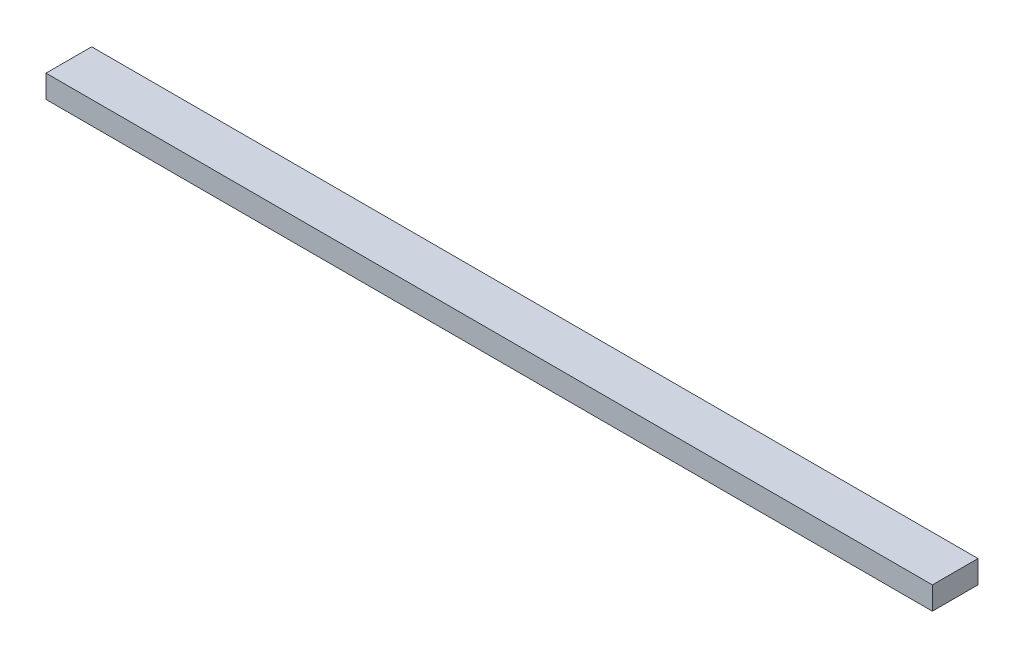
ISO-10303-21;
HEADER;
FILE_DESCRIPTION(('STEP AP214'),'2;1');
FILE_NAME('part.step','',(''),(''),'','','');
FILE_SCHEMA(('AUTOMOTIVE_DESIGN { 1 0 10303 214 1 1 1 1 }'));
ENDSEC;
DATA;
#1=APPLICATION_CONTEXT('core data for automotive mechanical design processes');
#2=APPLICATION_PROTOCOL_DEFINITION('international standard','automotive_design',2000,#1);
#3=PRODUCT_CONTEXT('',#1,'mechanical');
#4=PRODUCT('Part','Part','',(#3));
#5=PRODUCT_RELATED_PRODUCT_CATEGORY('part','',(#4));
#6=PRODUCT_DEFINITION_FORMATION('','',#4);
#7=PRODUCT_DEFINITION_CONTEXT('part definition',#1,'design');
#8=PRODUCT_DEFINITION('design','',#6,#7);
#9=PRODUCT_DEFINITION_SHAPE('','',#8);
#10=(LENGTH_UNIT() NAMED_UNIT(*) SI_UNIT(.MILLI.,.METRE.));
#11=(NAMED_UNIT(*) PLANE_ANGLE_UNIT() SI_UNIT($,.RADIAN.));
#12=(NAMED_UNIT(*) SI_UNIT($,.STERADIAN.) SOLID_ANGLE_UNIT());
#13=UNCERTAINTY_MEASURE_WITH_UNIT(LENGTH_MEASURE(1.E-05),#10,'distance_accuracy_value','');
#14=(GEOMETRIC_REPRESENTATION_CONTEXT(3) GLOBAL_UNCERTAINTY_ASSIGNED_CONTEXT((#13)) GLOBAL_UNIT_ASSIGNED_CONTEXT((#10,
#11,#12)) REPRESENTATION_CONTEXT('',''));
#15=CARTESIAN_POINT('',(0.,0.,0.));
#16=DIRECTION('',(0.,0.,1.));
#17=DIRECTION('',(1.,0.,0.));
#18=AXIS2_PLACEMENT_3D('',#15,#16,#17);
#19=CARTESIAN_POINT('',(740.,0.,0.));
#20=DIRECTION('',(0.,0.,-1.));
#21=DIRECTION('',(-1.,0.,0.));
#22=AXIS2_PLACEMENT_3D('',#19,#20,#21);
#23=PLANE('',#22);
#24=DIRECTION('',(0.,-1.,0.));
#25=VECTOR('',#24,1.);
#26=CARTESIAN_POINT('',(0.,0.,0.));
#27=LINE('',#26,#25);
#28=CARTESIAN_POINT('',(0.,19.05,0.));
#29=VERTEX_POINT('',#28);
#30=CARTESIAN_POINT('',(0.,0.,0.));
#31=VERTEX_POINT('',#30);
#32=EDGE_CURVE('E111',#29,#31,#27,.T.);
#33=ORIENTED_EDGE('',*,*,#32,.T.);
#34=DIRECTION('',(-1.,0.,0.));
#35=VECTOR('',#34,1.);
#36=CARTESIAN_POINT('',(740.,0.,0.));
#37=LINE('',#36,#35);
#38=CARTESIAN_POINT('',(740.,0.,0.));
#39=VERTEX_POINT('',#38);
#40=EDGE_CURVE('E11',#39,#31,#37,.T.);
#41=ORIENTED_EDGE('',*,*,#40,.F.);
#42=DIRECTION('',(0.,-1.,0.));
#43=VECTOR('',#42,1.);
#44=CARTESIAN_POINT('',(740.,0.,0.));
#45=LINE('',#44,#43);
#46=CARTESIAN_POINT('',(740.,19.05,0.));
#47=VERTEX_POINT('',#46);
#48=EDGE_CURVE('E95',#47,#39,#45,.T.);
#49=ORIENTED_EDGE('',*,*,#48,.F.);
#50=DIRECTION('',(-1.,0.,0.));
#51=VECTOR('',#50,1.);
#52=CARTESIAN_POINT('',(740.,19.05,0.));
#53=LINE('',#52,#51);
#54=EDGE_CURVE('E107',#47,#29,#53,.T.);
#55=ORIENTED_EDGE('',*,*,#54,.T.);
#56=EDGE_LOOP('',(#33,#41,#49,#55));
#57=FACE_BOUND('',#56,.T.);
#58=ADVANCED_FACE('F43',(#57),#23,.F.);
#59=CARTESIAN_POINT('',(740.,0.,0.));
#60=DIRECTION('',(0.,1.,0.));
#61=DIRECTION('',(0.,0.,1.));
#62=AXIS2_PLACEMENT_3D('',#59,#60,#61);
#63=PLANE('',#62);
#64=DIRECTION('',(0.,0.,-1.));
#65=VECTOR('',#64,1.);
#66=CARTESIAN_POINT('',(0.,0.,0.));
#67=LINE('',#66,#65);
#68=CARTESIAN_POINT('',(0.,0.,-38.1));
#69=VERTEX_POINT('',#68);
#70=EDGE_CURVE('E100',#31,#69,#67,.T.);
#71=ORIENTED_EDGE('',*,*,#70,.T.);
#72=DIRECTION('',(-1.,0.,0.));
#73=VECTOR('',#72,1.);
#74=CARTESIAN_POINT('',(740.,0.,-38.1));
#75=LINE('',#74,#73);
#76=CARTESIAN_POINT('',(740.,0.,-38.1));
#77=VERTEX_POINT('',#76);
#78=EDGE_CURVE('E52',#77,#69,#75,.T.);
#79=ORIENTED_EDGE('',*,*,#78,.F.);
#80=DIRECTION('',(0.,0.,-1.));
#81=VECTOR('',#80,1.);
#82=CARTESIAN_POINT('',(740.,0.,0.));
#83=LINE('',#82,#81);
#84=EDGE_CURVE('E90',#39,#77,#83,.T.);
#85=ORIENTED_EDGE('',*,*,#84,.F.);
#86=ORIENTED_EDGE('',*,*,#40,.T.);
#87=EDGE_LOOP('',(#71,#79,#85,#86));
#88=FACE_BOUND('',#87,.T.);
#89=ADVANCED_FACE('F99',(#88),#63,.F.);
#90=CARTESIAN_POINT('',(740.,0.,-38.1));
#91=DIRECTION('',(0.,0.,1.));
#92=DIRECTION('',(1.,0.,0.));
#93=AXIS2_PLACEMENT_3D('',#90,#91,#92);
#94=PLANE('',#93);
#95=DIRECTION('',(0.,1.,0.));
#96=VECTOR('',#95,1.);
#97=CARTESIAN_POINT('',(0.,0.,-38.1));
#98=LINE('',#97,#96);
#99=CARTESIAN_POINT('',(0.,19.05,-38.1));
#100=VERTEX_POINT('',#99);
#101=EDGE_CURVE('E77',#69,#100,#98,.T.);
#102=ORIENTED_EDGE('',*,*,#101,.T.);
#103=DIRECTION('',(-1.,0.,0.));
#104=VECTOR('',#103,1.);
#105=CARTESIAN_POINT('',(740.,19.05,-38.1));
#106=LINE('',#105,#104);
#107=CARTESIAN_POINT('',(740.,19.05,-38.1));
#108=VERTEX_POINT('',#107);
#109=EDGE_CURVE('E102',#108,#100,#106,.T.);
#110=ORIENTED_EDGE('',*,*,#109,.F.);
#111=DIRECTION('',(0.,1.,0.));
#112=VECTOR('',#111,1.);
#113=CARTESIAN_POINT('',(740.,0.,-38.1));
#114=LINE('',#113,#112);
#115=EDGE_CURVE('E93',#77,#108,#114,.T.);
#116=ORIENTED_EDGE('',*,*,#115,.F.);
#117=ORIENTED_EDGE('',*,*,#78,.T.);
#118=EDGE_LOOP('',(#102,#110,#116,#117));
#119=FACE_BOUND('',#118,.T.);
#120=ADVANCED_FACE('F103',(#119),#94,.F.);
#121=CARTESIAN_POINT('',(740.,19.05,0.));
#122=DIRECTION('',(0.,-1.,0.));
#123=DIRECTION('',(0.,0.,-1.));
#124=AXIS2_PLACEMENT_3D('',#121,#122,#123);
#125=PLANE('',#124);
#126=DIRECTION('',(0.,0.,1.));
#127=VECTOR('',#126,1.);
#128=CARTESIAN_POINT('',(0.,19.05,0.));
#129=LINE('',#128,#127);
#130=EDGE_CURVE('E83',#100,#29,#129,.T.);
#131=ORIENTED_EDGE('',*,*,#130,.T.);
#132=ORIENTED_EDGE('',*,*,#54,.F.);
#133=DIRECTION('',(0.,0.,1.));
#134=VECTOR('',#133,1.);
#135=CARTESIAN_POINT('',(740.,19.05,0.));
#136=LINE('',#135,#134);
#137=EDGE_CURVE('E60',#108,#47,#136,.T.);
#138=ORIENTED_EDGE('',*,*,#137,.F.);
#139=ORIENTED_EDGE('',*,*,#109,.T.);
#140=EDGE_LOOP('',(#131,#132,#138,#139));
#141=FACE_BOUND('',#140,.T.);
#142=ADVANCED_FACE('F124',(#141),#125,.F.);
#143=CARTESIAN_POINT('',(740.,0.,0.));
#144=DIRECTION('',(-1.,0.,0.));
#145=DIRECTION('',(0.,0.,1.));
#146=AXIS2_PLACEMENT_3D('',#143,#144,#145);
#147=PLANE('',#146);
#148=ORIENTED_EDGE('',*,*,#48,.T.);
#149=ORIENTED_EDGE('',*,*,#84,.T.);
#150=ORIENTED_EDGE('',*,*,#115,.T.);
#151=ORIENTED_EDGE('',*,*,#137,.T.);
#152=EDGE_LOOP('',(#148,#149,#150,#151));
#153=FACE_BOUND('',#152,.T.);
#154=ADVANCED_FACE('F91',(#153),#147,.F.);
#155=CARTESIAN_POINT('',(0.,0.,0.));
#156=DIRECTION('',(-1.,0.,0.));
#157=DIRECTION('',(0.,0.,1.));
#158=AXIS2_PLACEMENT_3D('',#155,#156,#157);
#159=PLANE('',#158);
#160=ORIENTED_EDGE('',*,*,#32,.F.);
#161=ORIENTED_EDGE('',*,*,#130,.F.);
#162=ORIENTED_EDGE('',*,*,#101,.F.);
#163=ORIENTED_EDGE('',*,*,#70,.F.);
#164=EDGE_LOOP('',(#160,#161,#162,#163));
#165=FACE_BOUND('',#164,.T.);
#166=ADVANCED_FACE('F127',(#165),#159,.T.);
#167=CLOSED_SHELL('',(#58,#89,#120,#142,#154,#166));
#168=MANIFOLD_SOLID_BREP('B2',#167);
#169=ADVANCED_BREP_SHAPE_REPRESENTATION('',(#18,#168),#14);
#170=SHAPE_DEFINITION_REPRESENTATION(#9,#169);
ENDSEC;
END-ISO-10303-21;
